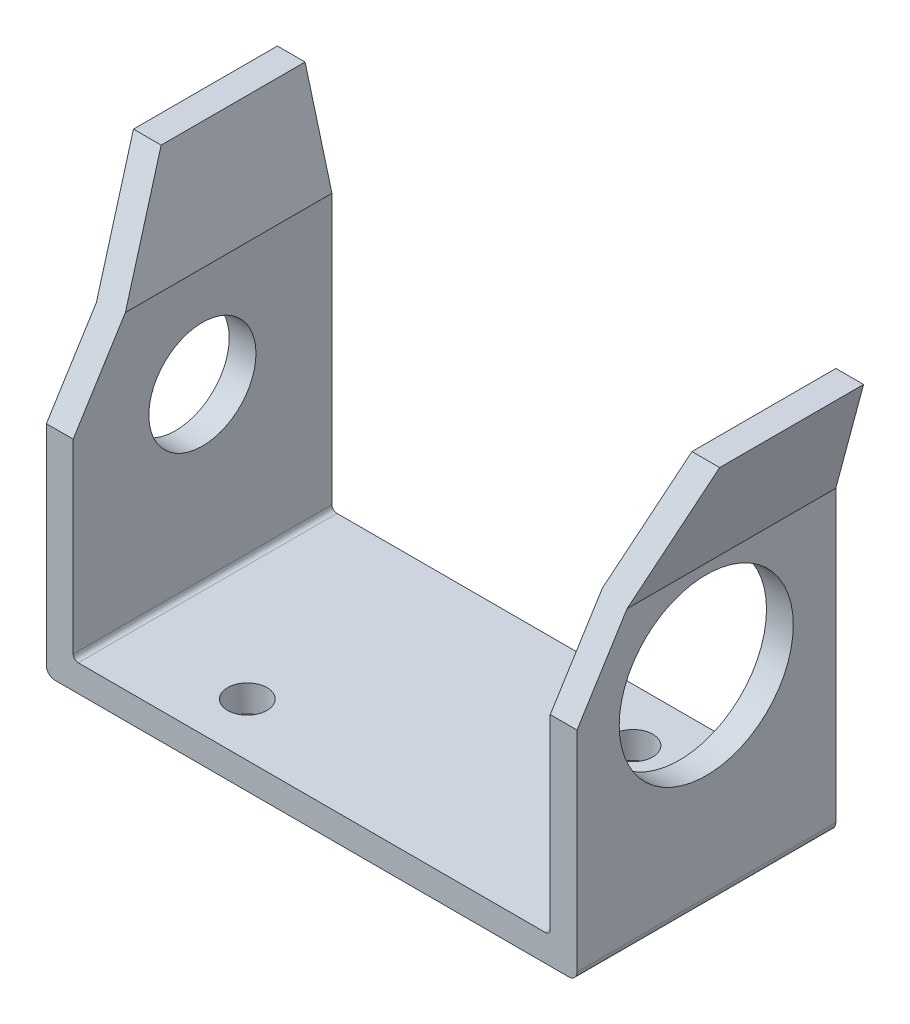
ISO-10303-21;
HEADER;
FILE_DESCRIPTION(('STEP AP214'),'2;1');
FILE_NAME('part.step','',(''),(''),'','','');
FILE_SCHEMA(('AUTOMOTIVE_DESIGN { 1 0 10303 214 1 1 1 1 }'));
ENDSEC;
DATA;
#1=APPLICATION_CONTEXT('core data for automotive mechanical design processes');
#2=APPLICATION_PROTOCOL_DEFINITION('international standard','automotive_design',2000,#1);
#3=PRODUCT_CONTEXT('',#1,'mechanical');
#4=PRODUCT('Part','Part','',(#3));
#5=PRODUCT_RELATED_PRODUCT_CATEGORY('part','',(#4));
#6=PRODUCT_DEFINITION_FORMATION('','',#4);
#7=PRODUCT_DEFINITION_CONTEXT('part definition',#1,'design');
#8=PRODUCT_DEFINITION('design','',#6,#7);
#9=PRODUCT_DEFINITION_SHAPE('','',#8);
#10=(LENGTH_UNIT() NAMED_UNIT(*) SI_UNIT(.MILLI.,.METRE.));
#11=(NAMED_UNIT(*) PLANE_ANGLE_UNIT() SI_UNIT($,.RADIAN.));
#12=(NAMED_UNIT(*) SI_UNIT($,.STERADIAN.) SOLID_ANGLE_UNIT());
#13=UNCERTAINTY_MEASURE_WITH_UNIT(LENGTH_MEASURE(1.E-05),#10,'distance_accuracy_value','');
#14=(GEOMETRIC_REPRESENTATION_CONTEXT(3) GLOBAL_UNCERTAINTY_ASSIGNED_CONTEXT((#13)) GLOBAL_UNIT_ASSIGNED_CONTEXT((#10,
#11,#12)) REPRESENTATION_CONTEXT('',''));
#15=CARTESIAN_POINT('',(0.,0.,0.));
#16=DIRECTION('',(0.,0.,1.));
#17=DIRECTION('',(1.,0.,0.));
#18=AXIS2_PLACEMENT_3D('',#15,#16,#17);
#19=CARTESIAN_POINT('',(6.975,-3.5,7.73));
#20=DIRECTION('',(0.,0.,-1.));
#21=DIRECTION('',(-1.,0.,0.));
#22=AXIS2_PLACEMENT_3D('',#19,#20,#21);
#23=CYLINDRICAL_SURFACE('',#22,0.15);
#24=DIRECTION('',(0.,0.,1.));
#25=VECTOR('',#24,1.);
#26=CARTESIAN_POINT('',(6.975,-3.65,7.73));
#27=LINE('',#26,#25);
#28=CARTESIAN_POINT('',(6.975,-3.65,0.));
#29=VERTEX_POINT('',#28);
#30=CARTESIAN_POINT('',(6.975,-3.65,7.73));
#31=VERTEX_POINT('',#30);
#32=EDGE_CURVE('E112',#29,#31,#27,.T.);
#33=ORIENTED_EDGE('',*,*,#32,.T.);
#34=CARTESIAN_POINT('',(6.975,-3.5,7.73));
#35=DIRECTION('',(0.,0.,-1.));
#36=DIRECTION('',(-1.,0.,0.));
#37=AXIS2_PLACEMENT_3D('',#34,#35,#36);
#38=CIRCLE('',#37,0.15);
#39=CARTESIAN_POINT('',(7.125,-3.5,7.73));
#40=VERTEX_POINT('',#39);
#41=EDGE_CURVE('E37',#40,#31,#38,.T.);
#42=ORIENTED_EDGE('',*,*,#41,.F.);
#43=DIRECTION('',(0.,0.,1.));
#44=VECTOR('',#43,1.);
#45=CARTESIAN_POINT('',(7.125,-3.5,7.73));
#46=LINE('',#45,#44);
#47=CARTESIAN_POINT('',(7.125,-3.5,0.));
#48=VERTEX_POINT('',#47);
#49=EDGE_CURVE('E200',#40,#48,#46,.F.);
#50=ORIENTED_EDGE('',*,*,#49,.T.);
#51=CARTESIAN_POINT('',(6.975,-3.5,0.));
#52=DIRECTION('',(0.,0.,-1.));
#53=DIRECTION('',(-1.,0.,0.));
#54=AXIS2_PLACEMENT_3D('',#51,#52,#53);
#55=CIRCLE('',#54,0.15);
#56=EDGE_CURVE('E109',#29,#48,#55,.F.);
#57=ORIENTED_EDGE('',*,*,#56,.F.);
#58=EDGE_LOOP('',(#33,#42,#50,#57));
#59=FACE_BOUND('',#58,.T.);
#60=ADVANCED_FACE('F34',(#59),#23,.F.);
#61=CARTESIAN_POINT('',(0.,7.55,7.73));
#62=DIRECTION('',(0.,-1.,0.));
#63=DIRECTION('',(0.,0.,-1.));
#64=AXIS2_PLACEMENT_3D('',#61,#62,#63);
#65=PLANE('',#64);
#66=DIRECTION('',(1.,0.,0.));
#67=VECTOR('',#66,1.);
#68=CARTESIAN_POINT('',(-8.75564249653648,7.55,4.29946725801778));
#69=LINE('',#68,#67);
#70=CARTESIAN_POINT('',(7.92742155220842,7.55,4.29946725801778));
#71=VERTEX_POINT('',#70);
#72=CARTESIAN_POINT('',(8.75564249653648,7.55,4.29946725801778));
#73=VERTEX_POINT('',#72);
#74=EDGE_CURVE('E269',#71,#73,#69,.T.);
#75=ORIENTED_EDGE('',*,*,#74,.T.);
#76=DIRECTION('',(0.,0.,1.));
#77=VECTOR('',#76,1.);
#78=CARTESIAN_POINT('',(8.75564249653648,7.55,7.73));
#79=LINE('',#78,#77);
#80=CARTESIAN_POINT('',(8.75564249653648,7.55,0.));
#81=VERTEX_POINT('',#80);
#82=EDGE_CURVE('E193',#81,#73,#79,.T.);
#83=ORIENTED_EDGE('',*,*,#82,.F.);
#84=DIRECTION('',(1.,0.,0.));
#85=VECTOR('',#84,1.);
#86=CARTESIAN_POINT('',(0.,7.55,0.));
#87=LINE('',#86,#85);
#88=CARTESIAN_POINT('',(7.92742155220842,7.55,0.));
#89=VERTEX_POINT('',#88);
#90=EDGE_CURVE('E272',#89,#81,#87,.T.);
#91=ORIENTED_EDGE('',*,*,#90,.F.);
#92=DIRECTION('',(0.,0.,1.));
#93=VECTOR('',#92,1.);
#94=CARTESIAN_POINT('',(7.92742155220842,7.55,7.73));
#95=LINE('',#94,#93);
#96=EDGE_CURVE('E222',#89,#71,#95,.T.);
#97=ORIENTED_EDGE('',*,*,#96,.T.);
#98=EDGE_LOOP('',(#75,#83,#91,#97));
#99=FACE_BOUND('',#98,.T.);
#100=ADVANCED_FACE('F404',(#99),#65,.F.);
#101=CARTESIAN_POINT('',(7.125,1.55,3.87));
#102=DIRECTION('',(1.,0.,0.));
#103=DIRECTION('',(0.,0.,-1.));
#104=AXIS2_PLACEMENT_3D('',#101,#102,#103);
#105=CYLINDRICAL_SURFACE('',#104,2.6);
#106=CARTESIAN_POINT('',(7.125,1.55,3.87));
#107=DIRECTION('',(1.,0.,0.));
#108=DIRECTION('',(0.,0.,-1.));
#109=AXIS2_PLACEMENT_3D('',#106,#107,#108);
#110=CIRCLE('',#109,2.6);
#111=CARTESIAN_POINT('',(7.125,1.55,1.27));
#112=VERTEX_POINT('',#111);
#113=EDGE_CURVE('E203',#112,#112,#110,.F.);
#114=ORIENTED_EDGE('',*,*,#113,.T.);
#115=EDGE_LOOP('',(#114));
#116=FACE_BOUND('',#115,.T.);
#117=CARTESIAN_POINT('',(7.925,1.55,3.87));
#118=DIRECTION('',(1.,0.,0.));
#119=DIRECTION('',(0.,0.,-1.));
#120=AXIS2_PLACEMENT_3D('',#117,#118,#119);
#121=CIRCLE('',#120,2.6);
#122=CARTESIAN_POINT('',(7.925,1.55,1.27));
#123=VERTEX_POINT('',#122);
#124=EDGE_CURVE('E196',#123,#123,#121,.T.);
#125=ORIENTED_EDGE('',*,*,#124,.T.);
#126=EDGE_LOOP('',(#125));
#127=FACE_BOUND('',#126,.T.);
#128=ADVANCED_FACE('F468',(#116,#127),#105,.F.);
#129=CARTESIAN_POINT('',(-8.75564249653648,2.06,7.73));
#130=DIRECTION('',(0.,-0.529919264233206,-0.848048096156425));
#131=DIRECTION('',(0.,0.848048096156425,-0.529919264233206));
#132=AXIS2_PLACEMENT_3D('',#129,#130,#131);
#133=PLANE('',#132);
#134=DIRECTION('',(0.,0.848048096156425,-0.529919264233207));
#135=VECTOR('',#134,1.);
#136=CARTESIAN_POINT('',(7.925,2.06,7.73));
#137=LINE('',#136,#135);
#138=CARTESIAN_POINT('',(7.925,2.06,7.73));
#139=VERTEX_POINT('',#138);
#140=CARTESIAN_POINT('',(7.925,4.45,6.2365622489367));
#141=VERTEX_POINT('',#140);
#142=EDGE_CURVE('E183',#139,#141,#137,.T.);
#143=ORIENTED_EDGE('',*,*,#142,.T.);
#144=DIRECTION('',(-0.221585010600198,-0.826966517755628,0.516746032000673));
#145=VECTOR('',#144,1.);
#146=CARTESIAN_POINT('',(8.75564249653648,7.55,4.29946725801778));
#147=LINE('',#146,#145);
#148=EDGE_CURVE('E197',#73,#141,#147,.T.);
#149=ORIENTED_EDGE('',*,*,#148,.F.);
#150=ORIENTED_EDGE('',*,*,#74,.F.);
#151=DIRECTION('',(-0.221585010600199,-0.826966517755627,0.516746032000674));
#152=VECTOR('',#151,1.);
#153=CARTESIAN_POINT('',(7.92742155220842,7.55,4.29946725801778));
#154=LINE('',#153,#152);
#155=CARTESIAN_POINT('',(7.125,4.55532199806992,6.17074976026096));
#156=VERTEX_POINT('',#155);
#157=EDGE_CURVE('E207',#71,#156,#154,.T.);
#158=ORIENTED_EDGE('',*,*,#157,.T.);
#159=DIRECTION('',(0.,-0.848048096156425,0.529919264233207));
#160=VECTOR('',#159,1.);
#161=CARTESIAN_POINT('',(7.125,4.55532199806992,6.17074976026096));
#162=LINE('',#161,#160);
#163=CARTESIAN_POINT('',(7.125,2.06,7.73));
#164=VERTEX_POINT('',#163);
#165=EDGE_CURVE('E202',#156,#164,#162,.T.);
#166=ORIENTED_EDGE('',*,*,#165,.T.);
#167=DIRECTION('',(1.,0.,0.));
#168=VECTOR('',#167,1.);
#169=CARTESIAN_POINT('',(-8.75564249653648,2.06,7.73));
#170=LINE('',#169,#168);
#171=EDGE_CURVE('E248',#139,#164,#170,.F.);
#172=ORIENTED_EDGE('',*,*,#171,.F.);
#173=EDGE_LOOP('',(#143,#149,#150,#158,#166,#172));
#174=FACE_BOUND('',#173,.T.);
#175=ADVANCED_FACE('F397',(#174),#133,.F.);
#176=CARTESIAN_POINT('',(0.,7.55,7.73));
#177=DIRECTION('',(0.,1.,0.));
#178=DIRECTION('',(0.,0.,1.));
#179=AXIS2_PLACEMENT_3D('',#176,#177,#178);
#180=PLANE('',#179);
#181=DIRECTION('',(1.,0.,0.));
#182=VECTOR('',#181,1.);
#183=CARTESIAN_POINT('',(0.,7.55,0.));
#184=LINE('',#183,#182);
#185=CARTESIAN_POINT('',(-7.92742155220842,7.55,0.));
#186=VERTEX_POINT('',#185);
#187=CARTESIAN_POINT('',(-8.75564249653648,7.55,0.));
#188=VERTEX_POINT('',#187);
#189=EDGE_CURVE('E244',#186,#188,#184,.F.);
#190=ORIENTED_EDGE('',*,*,#189,.T.);
#191=DIRECTION('',(0.,0.,1.));
#192=VECTOR('',#191,1.);
#193=CARTESIAN_POINT('',(-8.75564249653648,7.55,7.73));
#194=LINE('',#193,#192);
#195=CARTESIAN_POINT('',(-8.75564249653648,7.55,4.29946725801778));
#196=VERTEX_POINT('',#195);
#197=EDGE_CURVE('E232',#188,#196,#194,.T.);
#198=ORIENTED_EDGE('',*,*,#197,.T.);
#199=DIRECTION('',(1.,0.,0.));
#200=VECTOR('',#199,1.);
#201=CARTESIAN_POINT('',(-8.75564249653648,7.55,4.29946725801778));
#202=LINE('',#201,#200);
#203=CARTESIAN_POINT('',(-7.92742155220842,7.55,4.29946725801778));
#204=VERTEX_POINT('',#203);
#205=EDGE_CURVE('E241',#196,#204,#202,.T.);
#206=ORIENTED_EDGE('',*,*,#205,.T.);
#207=DIRECTION('',(0.,0.,1.));
#208=VECTOR('',#207,1.);
#209=CARTESIAN_POINT('',(-7.92742155220842,7.55,7.73));
#210=LINE('',#209,#208);
#211=EDGE_CURVE('E157',#186,#204,#210,.T.);
#212=ORIENTED_EDGE('',*,*,#211,.F.);
#213=EDGE_LOOP('',(#190,#198,#206,#212));
#214=FACE_BOUND('',#213,.T.);
#215=ADVANCED_FACE('F461',(#214),#180,.T.);
#216=CARTESIAN_POINT('',(-8.75564249653648,1.55,3.87));
#217=DIRECTION('',(1.,0.,0.));
#218=DIRECTION('',(0.,0.,-1.));
#219=AXIS2_PLACEMENT_3D('',#216,#217,#218);
#220=CYLINDRICAL_SURFACE('',#219,1.59999218748093);
#221=CARTESIAN_POINT('',(-7.125,1.55,3.87));
#222=DIRECTION('',(1.,0.,0.));
#223=DIRECTION('',(0.,0.,-1.));
#224=AXIS2_PLACEMENT_3D('',#221,#222,#223);
#225=CIRCLE('',#224,1.59999218748093);
#226=CARTESIAN_POINT('',(-7.125,1.55,2.27000781251907));
#227=VERTEX_POINT('',#226);
#228=EDGE_CURVE('E143',#227,#227,#225,.T.);
#229=ORIENTED_EDGE('',*,*,#228,.T.);
#230=EDGE_LOOP('',(#229));
#231=FACE_BOUND('',#230,.T.);
#232=CARTESIAN_POINT('',(-7.925,1.55,3.87));
#233=DIRECTION('',(1.,0.,0.));
#234=DIRECTION('',(0.,0.,-1.));
#235=AXIS2_PLACEMENT_3D('',#232,#233,#234);
#236=CIRCLE('',#235,1.59999218748093);
#237=CARTESIAN_POINT('',(-7.925,1.55,2.27000781251907));
#238=VERTEX_POINT('',#237);
#239=EDGE_CURVE('E182',#238,#238,#236,.F.);
#240=ORIENTED_EDGE('',*,*,#239,.T.);
#241=EDGE_LOOP('',(#240));
#242=FACE_BOUND('',#241,.T.);
#243=ADVANCED_FACE('F457',(#231,#242),#220,.F.);
#244=CARTESIAN_POINT('',(-6.975,-3.5,7.73));
#245=DIRECTION('',(0.,0.,-1.));
#246=DIRECTION('',(-1.,0.,0.));
#247=AXIS2_PLACEMENT_3D('',#244,#245,#246);
#248=CYLINDRICAL_SURFACE('',#247,0.15);
#249=DIRECTION('',(0.,0.,1.));
#250=VECTOR('',#249,1.);
#251=CARTESIAN_POINT('',(-7.125,-3.5,7.73));
#252=LINE('',#251,#250);
#253=CARTESIAN_POINT('',(-7.125,-3.5,0.));
#254=VERTEX_POINT('',#253);
#255=CARTESIAN_POINT('',(-7.125,-3.5,7.73));
#256=VERTEX_POINT('',#255);
#257=EDGE_CURVE('E139',#254,#256,#252,.T.);
#258=ORIENTED_EDGE('',*,*,#257,.T.);
#259=CARTESIAN_POINT('',(-6.975,-3.5,7.73));
#260=DIRECTION('',(0.,0.,-1.));
#261=DIRECTION('',(-1.,0.,0.));
#262=AXIS2_PLACEMENT_3D('',#259,#260,#261);
#263=CIRCLE('',#262,0.15);
#264=CARTESIAN_POINT('',(-6.975,-3.65,7.73));
#265=VERTEX_POINT('',#264);
#266=EDGE_CURVE('E247',#265,#256,#263,.T.);
#267=ORIENTED_EDGE('',*,*,#266,.F.);
#268=DIRECTION('',(0.,0.,1.));
#269=VECTOR('',#268,1.);
#270=CARTESIAN_POINT('',(-6.975,-3.65,7.73));
#271=LINE('',#270,#269);
#272=CARTESIAN_POINT('',(-6.975,-3.65,0.));
#273=VERTEX_POINT('',#272);
#274=EDGE_CURVE('E116',#265,#273,#271,.F.);
#275=ORIENTED_EDGE('',*,*,#274,.T.);
#276=CARTESIAN_POINT('',(-6.975,-3.5,0.));
#277=DIRECTION('',(0.,0.,-1.));
#278=DIRECTION('',(-1.,0.,0.));
#279=AXIS2_PLACEMENT_3D('',#276,#277,#278);
#280=CIRCLE('',#279,0.15);
#281=EDGE_CURVE('E253',#254,#273,#280,.F.);
#282=ORIENTED_EDGE('',*,*,#281,.F.);
#283=EDGE_LOOP('',(#258,#267,#275,#282));
#284=FACE_BOUND('',#283,.T.);
#285=ADVANCED_FACE('F450',(#284),#248,.F.);
#286=CARTESIAN_POINT('',(-8.75564249653648,2.06,7.73));
#287=DIRECTION('',(0.,-0.529919264233206,-0.848048096156425));
#288=DIRECTION('',(0.,0.848048096156425,-0.529919264233206));
#289=AXIS2_PLACEMENT_3D('',#286,#287,#288);
#290=PLANE('',#289);
#291=DIRECTION('',(0.,0.848048096156425,-0.529919264233207));
#292=VECTOR('',#291,1.);
#293=CARTESIAN_POINT('',(-7.125,2.06,7.73));
#294=LINE('',#293,#292);
#295=CARTESIAN_POINT('',(-7.125,2.06,7.73));
#296=VERTEX_POINT('',#295);
#297=CARTESIAN_POINT('',(-7.125,4.55532199806992,6.17074976026095));
#298=VERTEX_POINT('',#297);
#299=EDGE_CURVE('E142',#296,#298,#294,.T.);
#300=ORIENTED_EDGE('',*,*,#299,.T.);
#301=DIRECTION('',(0.221585010600199,-0.826966517755628,0.516746032000674));
#302=VECTOR('',#301,1.);
#303=CARTESIAN_POINT('',(-7.92742155220842,7.55,4.29946725801778));
#304=LINE('',#303,#302);
#305=EDGE_CURVE('E160',#204,#298,#304,.T.);
#306=ORIENTED_EDGE('',*,*,#305,.F.);
#307=ORIENTED_EDGE('',*,*,#205,.F.);
#308=DIRECTION('',(0.221585010600198,-0.826966517755628,0.516746032000673));
#309=VECTOR('',#308,1.);
#310=CARTESIAN_POINT('',(-8.75564249653648,7.55,4.29946725801778));
#311=LINE('',#310,#309);
#312=CARTESIAN_POINT('',(-7.925,4.45,6.2365622489367));
#313=VERTEX_POINT('',#312);
#314=EDGE_CURVE('E166',#196,#313,#311,.T.);
#315=ORIENTED_EDGE('',*,*,#314,.T.);
#316=DIRECTION('',(0.,-0.848048096156425,0.529919264233206));
#317=VECTOR('',#316,1.);
#318=CARTESIAN_POINT('',(-7.925,4.45,6.2365622489367));
#319=LINE('',#318,#317);
#320=CARTESIAN_POINT('',(-7.925,2.06,7.73));
#321=VERTEX_POINT('',#320);
#322=EDGE_CURVE('E229',#313,#321,#319,.T.);
#323=ORIENTED_EDGE('',*,*,#322,.T.);
#324=DIRECTION('',(1.,0.,0.));
#325=VECTOR('',#324,1.);
#326=CARTESIAN_POINT('',(-8.75564249653648,2.06,7.73));
#327=LINE('',#326,#325);
#328=EDGE_CURVE('E117',#296,#321,#327,.F.);
#329=ORIENTED_EDGE('',*,*,#328,.F.);
#330=EDGE_LOOP('',(#300,#306,#307,#315,#323,#329));
#331=FACE_BOUND('',#330,.T.);
#332=ADVANCED_FACE('F442',(#331),#290,.F.);
#333=CARTESIAN_POINT('',(-6.975,-3.65,7.73));
#334=DIRECTION('',(0.,-1.,0.));
#335=DIRECTION('',(1.,0.,0.));
#336=AXIS2_PLACEMENT_3D('',#333,#334,#335);
#337=PLANE('',#336);
#338=CARTESIAN_POINT('',(-3.5125,-3.65,6.1425));
#339=DIRECTION('',(0.,-1.,0.));
#340=DIRECTION('',(1.,0.,0.));
#341=AXIS2_PLACEMENT_3D('',#338,#339,#340);
#342=CIRCLE('',#341,0.590549999999993);
#343=CARTESIAN_POINT('',(-2.92195000000001,-3.65,6.1425));
#344=VERTEX_POINT('',#343);
#345=EDGE_CURVE('E420',#344,#344,#342,.T.);
#346=ORIENTED_EDGE('',*,*,#345,.T.);
#347=EDGE_LOOP('',(#346));
#348=FACE_BOUND('',#347,.T.);
#349=CARTESIAN_POINT('',(3.4525,-3.65,1.5875));
#350=DIRECTION('',(0.,-1.,0.));
#351=DIRECTION('',(1.,0.,0.));
#352=AXIS2_PLACEMENT_3D('',#349,#350,#351);
#353=CIRCLE('',#352,0.590549999999993);
#354=CARTESIAN_POINT('',(4.04304999999999,-3.65,1.5875));
#355=VERTEX_POINT('',#354);
#356=EDGE_CURVE('E110',#355,#355,#353,.T.);
#357=ORIENTED_EDGE('',*,*,#356,.T.);
#358=EDGE_LOOP('',(#357));
#359=FACE_BOUND('',#358,.T.);
#360=ORIENTED_EDGE('',*,*,#274,.F.);
#361=DIRECTION('',(-1.,0.,0.));
#362=VECTOR('',#361,1.);
#363=CARTESIAN_POINT('',(-6.975,-3.65,7.73));
#364=LINE('',#363,#362);
#365=EDGE_CURVE('E106',#265,#31,#364,.F.);
#366=ORIENTED_EDGE('',*,*,#365,.T.);
#367=ORIENTED_EDGE('',*,*,#32,.F.);
#368=DIRECTION('',(-1.,0.,0.));
#369=VECTOR('',#368,1.);
#370=CARTESIAN_POINT('',(-6.975,-3.65,0.));
#371=LINE('',#370,#369);
#372=EDGE_CURVE('E294',#273,#29,#371,.F.);
#373=ORIENTED_EDGE('',*,*,#372,.F.);
#374=EDGE_LOOP('',(#360,#366,#367,#373));
#375=FACE_BOUND('',#374,.T.);
#376=ADVANCED_FACE('F120',(#348,#359,#375),#337,.F.);
#377=CARTESIAN_POINT('',(7.125,4.45,7.73));
#378=DIRECTION('',(1.,0.,0.));
#379=DIRECTION('',(0.,1.,0.));
#380=AXIS2_PLACEMENT_3D('',#377,#378,#379);
#381=PLANE('',#380);
#382=ORIENTED_EDGE('',*,*,#165,.F.);
#383=DIRECTION('',(0.,0.,1.));
#384=VECTOR('',#383,1.);
#385=CARTESIAN_POINT('',(7.125,4.55532199806992,7.73));
#386=LINE('',#385,#384);
#387=CARTESIAN_POINT('',(7.12500000000001,4.55532199806994,0.));
#388=VERTEX_POINT('',#387);
#389=EDGE_CURVE('E204',#156,#388,#386,.F.);
#390=ORIENTED_EDGE('',*,*,#389,.T.);
#391=DIRECTION('',(0.,1.,0.));
#392=VECTOR('',#391,1.);
#393=CARTESIAN_POINT('',(7.125,-3.5,0.));
#394=LINE('',#393,#392);
#395=EDGE_CURVE('E212',#48,#388,#394,.T.);
#396=ORIENTED_EDGE('',*,*,#395,.F.);
#397=ORIENTED_EDGE('',*,*,#49,.F.);
#398=DIRECTION('',(0.,1.,0.));
#399=VECTOR('',#398,1.);
#400=CARTESIAN_POINT('',(7.125,-3.5,7.73));
#401=LINE('',#400,#399);
#402=EDGE_CURVE('E108',#40,#164,#401,.T.);
#403=ORIENTED_EDGE('',*,*,#402,.T.);
#404=EDGE_LOOP('',(#382,#390,#396,#397,#403));
#405=FACE_BOUND('',#404,.T.);
#406=ORIENTED_EDGE('',*,*,#113,.F.);
#407=EDGE_LOOP('',(#406));
#408=FACE_BOUND('',#407,.T.);
#409=ADVANCED_FACE('F311',(#405,#408),#381,.F.);
#410=CARTESIAN_POINT('',(1.73307400330687,-15.5676197722403,7.73));
#411=DIRECTION('',(0.965925826289068,-0.258819045102521,0.));
#412=DIRECTION('',(0.258819045102521,0.965925826289068,0.));
#413=AXIS2_PLACEMENT_3D('',#410,#411,#412);
#414=PLANE('',#413);
#415=ORIENTED_EDGE('',*,*,#157,.F.);
#416=ORIENTED_EDGE('',*,*,#96,.F.);
#417=DIRECTION('',(0.258819045102521,0.965925826289068,0.));
#418=VECTOR('',#417,1.);
#419=CARTESIAN_POINT('',(7.125,4.55532199806992,0.));
#420=LINE('',#419,#418);
#421=EDGE_CURVE('E190',#388,#89,#420,.T.);
#422=ORIENTED_EDGE('',*,*,#421,.F.);
#423=ORIENTED_EDGE('',*,*,#389,.F.);
#424=EDGE_LOOP('',(#415,#416,#422,#423));
#425=FACE_BOUND('',#424,.T.);
#426=ADVANCED_FACE('F402',(#425),#414,.F.);
#427=CARTESIAN_POINT('',(2.50581466433813,-15.7746750083223,7.73));
#428=DIRECTION('',(0.965925826289068,-0.258819045102521,0.));
#429=DIRECTION('',(0.258819045102521,0.965925826289068,0.));
#430=AXIS2_PLACEMENT_3D('',#427,#428,#429);
#431=PLANE('',#430);
#432=DIRECTION('',(-0.258819045102521,-0.965925826289068,0.));
#433=VECTOR('',#432,1.);
#434=CARTESIAN_POINT('',(8.75564249653648,7.55,0.));
#435=LINE('',#434,#433);
#436=CARTESIAN_POINT('',(7.925,4.45000000000001,0.));
#437=VERTEX_POINT('',#436);
#438=EDGE_CURVE('E186',#81,#437,#435,.T.);
#439=ORIENTED_EDGE('',*,*,#438,.F.);
#440=ORIENTED_EDGE('',*,*,#82,.T.);
#441=ORIENTED_EDGE('',*,*,#148,.T.);
#442=DIRECTION('',(0.,0.,1.));
#443=VECTOR('',#442,1.);
#444=CARTESIAN_POINT('',(7.925,4.45,7.73));
#445=LINE('',#444,#443);
#446=EDGE_CURVE('E179',#141,#437,#445,.F.);
#447=ORIENTED_EDGE('',*,*,#446,.T.);
#448=EDGE_LOOP('',(#439,#440,#441,#447));
#449=FACE_BOUND('',#448,.T.);
#450=ADVANCED_FACE('F406',(#449),#431,.T.);
#451=CARTESIAN_POINT('',(7.925,4.45,7.73));
#452=DIRECTION('',(-1.,0.,0.));
#453=DIRECTION('',(0.,0.,1.));
#454=AXIS2_PLACEMENT_3D('',#451,#452,#453);
#455=PLANE('',#454);
#456=ORIENTED_EDGE('',*,*,#142,.F.);
#457=DIRECTION('',(0.,1.,0.));
#458=VECTOR('',#457,1.);
#459=CARTESIAN_POINT('',(7.925,-3.5,7.73));
#460=LINE('',#459,#458);
#461=CARTESIAN_POINT('',(7.925,-4.2,7.73));
#462=VERTEX_POINT('',#461);
#463=EDGE_CURVE('E124',#139,#462,#460,.F.);
#464=ORIENTED_EDGE('',*,*,#463,.T.);
#465=DIRECTION('',(0.,0.,-1.));
#466=VECTOR('',#465,1.);
#467=CARTESIAN_POINT('',(7.925,-4.2,7.73));
#468=LINE('',#467,#466);
#469=CARTESIAN_POINT('',(7.925,-4.2,0.));
#470=VERTEX_POINT('',#469);
#471=EDGE_CURVE('E176',#470,#462,#468,.F.);
#472=ORIENTED_EDGE('',*,*,#471,.F.);
#473=DIRECTION('',(0.,1.,0.));
#474=VECTOR('',#473,1.);
#475=CARTESIAN_POINT('',(7.925,-3.5,0.));
#476=LINE('',#475,#474);
#477=EDGE_CURVE('E189',#437,#470,#476,.F.);
#478=ORIENTED_EDGE('',*,*,#477,.F.);
#479=ORIENTED_EDGE('',*,*,#446,.F.);
#480=EDGE_LOOP('',(#456,#464,#472,#478,#479));
#481=FACE_BOUND('',#480,.T.);
#482=ORIENTED_EDGE('',*,*,#124,.F.);
#483=EDGE_LOOP('',(#482));
#484=FACE_BOUND('',#483,.T.);
#485=ADVANCED_FACE('F339',(#481,#484),#455,.F.);
#486=CARTESIAN_POINT('',(-7.925,4.45,7.73));
#487=DIRECTION('',(1.,0.,0.));
#488=DIRECTION('',(0.,0.,-1.));
#489=AXIS2_PLACEMENT_3D('',#486,#487,#488);
#490=PLANE('',#489);
#491=ORIENTED_EDGE('',*,*,#322,.F.);
#492=DIRECTION('',(0.,0.,1.));
#493=VECTOR('',#492,1.);
#494=CARTESIAN_POINT('',(-7.925,4.45,7.73));
#495=LINE('',#494,#493);
#496=CARTESIAN_POINT('',(-7.925,4.44999999999999,0.));
#497=VERTEX_POINT('',#496);
#498=EDGE_CURVE('E163',#313,#497,#495,.F.);
#499=ORIENTED_EDGE('',*,*,#498,.T.);
#500=DIRECTION('',(0.,1.,0.));
#501=VECTOR('',#500,1.);
#502=CARTESIAN_POINT('',(-7.925,-3.5,0.));
#503=LINE('',#502,#501);
#504=CARTESIAN_POINT('',(-7.925,-4.2,0.));
#505=VERTEX_POINT('',#504);
#506=EDGE_CURVE('E171',#505,#497,#503,.T.);
#507=ORIENTED_EDGE('',*,*,#506,.F.);
#508=DIRECTION('',(0.,0.,-1.));
#509=VECTOR('',#508,1.);
#510=CARTESIAN_POINT('',(-7.925,-4.2,7.73));
#511=LINE('',#510,#509);
#512=CARTESIAN_POINT('',(-7.925,-4.2,7.73));
#513=VERTEX_POINT('',#512);
#514=EDGE_CURVE('E147',#513,#505,#511,.T.);
#515=ORIENTED_EDGE('',*,*,#514,.F.);
#516=DIRECTION('',(0.,1.,0.));
#517=VECTOR('',#516,1.);
#518=CARTESIAN_POINT('',(-7.925,-3.5,7.73));
#519=LINE('',#518,#517);
#520=EDGE_CURVE('E127',#513,#321,#519,.T.);
#521=ORIENTED_EDGE('',*,*,#520,.T.);
#522=EDGE_LOOP('',(#491,#499,#507,#515,#521));
#523=FACE_BOUND('',#522,.T.);
#524=ORIENTED_EDGE('',*,*,#239,.F.);
#525=EDGE_LOOP('',(#524));
#526=FACE_BOUND('',#525,.T.);
#527=ADVANCED_FACE('F558',(#523,#526),#490,.F.);
#528=CARTESIAN_POINT('',(-2.50581466433813,-15.7746750083223,7.73));
#529=DIRECTION('',(0.965925826289068,0.258819045102521,0.));
#530=DIRECTION('',(-0.258819045102521,0.965925826289068,0.));
#531=AXIS2_PLACEMENT_3D('',#528,#529,#530);
#532=PLANE('',#531);
#533=ORIENTED_EDGE('',*,*,#314,.F.);
#534=ORIENTED_EDGE('',*,*,#197,.F.);
#535=DIRECTION('',(-0.258819045102521,0.965925826289068,0.));
#536=VECTOR('',#535,1.);
#537=CARTESIAN_POINT('',(-7.925,4.45,0.));
#538=LINE('',#537,#536);
#539=EDGE_CURVE('E154',#497,#188,#538,.T.);
#540=ORIENTED_EDGE('',*,*,#539,.F.);
#541=ORIENTED_EDGE('',*,*,#498,.F.);
#542=EDGE_LOOP('',(#533,#534,#540,#541));
#543=FACE_BOUND('',#542,.T.);
#544=ADVANCED_FACE('F550',(#543),#532,.F.);
#545=CARTESIAN_POINT('',(-1.73307400330687,-15.5676197722403,7.73));
#546=DIRECTION('',(0.965925826289068,0.258819045102521,0.));
#547=DIRECTION('',(-0.258819045102521,0.965925826289068,0.));
#548=AXIS2_PLACEMENT_3D('',#545,#546,#547);
#549=PLANE('',#548);
#550=DIRECTION('',(0.258819045102521,-0.965925826289068,0.));
#551=VECTOR('',#550,1.);
#552=CARTESIAN_POINT('',(-7.92742155220842,7.55,0.));
#553=LINE('',#552,#551);
#554=CARTESIAN_POINT('',(-7.125,4.55532199806992,0.));
#555=VERTEX_POINT('',#554);
#556=EDGE_CURVE('E150',#186,#555,#553,.T.);
#557=ORIENTED_EDGE('',*,*,#556,.F.);
#558=ORIENTED_EDGE('',*,*,#211,.T.);
#559=ORIENTED_EDGE('',*,*,#305,.T.);
#560=DIRECTION('',(0.,0.,1.));
#561=VECTOR('',#560,1.);
#562=CARTESIAN_POINT('',(-7.125,4.55532199806992,7.73));
#563=LINE('',#562,#561);
#564=EDGE_CURVE('E144',#298,#555,#563,.F.);
#565=ORIENTED_EDGE('',*,*,#564,.T.);
#566=EDGE_LOOP('',(#557,#558,#559,#565));
#567=FACE_BOUND('',#566,.T.);
#568=ADVANCED_FACE('F540',(#567),#549,.T.);
#569=CARTESIAN_POINT('',(-7.125,4.45,7.73));
#570=DIRECTION('',(-1.,0.,0.));
#571=DIRECTION('',(0.,0.,1.));
#572=AXIS2_PLACEMENT_3D('',#569,#570,#571);
#573=PLANE('',#572);
#574=ORIENTED_EDGE('',*,*,#299,.F.);
#575=DIRECTION('',(0.,1.,0.));
#576=VECTOR('',#575,1.);
#577=CARTESIAN_POINT('',(-7.125,-3.5,7.73));
#578=LINE('',#577,#576);
#579=EDGE_CURVE('E122',#296,#256,#578,.F.);
#580=ORIENTED_EDGE('',*,*,#579,.T.);
#581=ORIENTED_EDGE('',*,*,#257,.F.);
#582=DIRECTION('',(0.,1.,0.));
#583=VECTOR('',#582,1.);
#584=CARTESIAN_POINT('',(-7.125,-3.5,0.));
#585=LINE('',#584,#583);
#586=EDGE_CURVE('E153',#555,#254,#585,.F.);
#587=ORIENTED_EDGE('',*,*,#586,.F.);
#588=ORIENTED_EDGE('',*,*,#564,.F.);
#589=EDGE_LOOP('',(#574,#580,#581,#587,#588));
#590=FACE_BOUND('',#589,.T.);
#591=ORIENTED_EDGE('',*,*,#228,.F.);
#592=EDGE_LOOP('',(#591));
#593=FACE_BOUND('',#592,.T.);
#594=ADVANCED_FACE('F531',(#590,#593),#573,.F.);
#595=CARTESIAN_POINT('',(-7.675,-4.2,7.73));
#596=DIRECTION('',(0.,0.,-1.));
#597=DIRECTION('',(-1.,0.,0.));
#598=AXIS2_PLACEMENT_3D('',#595,#596,#597);
#599=CYLINDRICAL_SURFACE('',#598,0.25);
#600=CARTESIAN_POINT('',(-7.675,-4.2,7.73));
#601=DIRECTION('',(0.,0.,-1.));
#602=DIRECTION('',(-1.,0.,0.));
#603=AXIS2_PLACEMENT_3D('',#600,#601,#602);
#604=CIRCLE('',#603,0.25);
#605=CARTESIAN_POINT('',(-7.675,-4.45,7.73));
#606=VERTEX_POINT('',#605);
#607=EDGE_CURVE('E136',#606,#513,#604,.T.);
#608=ORIENTED_EDGE('',*,*,#607,.T.);
#609=ORIENTED_EDGE('',*,*,#514,.T.);
#610=CARTESIAN_POINT('',(-7.675,-4.2,0.));
#611=DIRECTION('',(0.,0.,-1.));
#612=DIRECTION('',(-1.,0.,0.));
#613=AXIS2_PLACEMENT_3D('',#610,#611,#612);
#614=CIRCLE('',#613,0.25);
#615=CARTESIAN_POINT('',(-7.675,-4.45,0.));
#616=VERTEX_POINT('',#615);
#617=EDGE_CURVE('E289',#616,#505,#614,.T.);
#618=ORIENTED_EDGE('',*,*,#617,.F.);
#619=DIRECTION('',(0.,0.,1.));
#620=VECTOR('',#619,1.);
#621=CARTESIAN_POINT('',(-7.675,-4.45,7.73));
#622=LINE('',#621,#620);
#623=EDGE_CURVE('E326',#616,#606,#622,.T.);
#624=ORIENTED_EDGE('',*,*,#623,.T.);
#625=EDGE_LOOP('',(#608,#609,#618,#624));
#626=FACE_BOUND('',#625,.T.);
#627=ADVANCED_FACE('F523',(#626),#599,.T.);
#628=CARTESIAN_POINT('',(-6.975,-3.5,7.73));
#629=DIRECTION('',(0.,0.,-1.));
#630=DIRECTION('',(-1.,0.,0.));
#631=AXIS2_PLACEMENT_3D('',#628,#629,#630);
#632=PLANE('',#631);
#633=ORIENTED_EDGE('',*,*,#171,.T.);
#634=ORIENTED_EDGE('',*,*,#402,.F.);
#635=ORIENTED_EDGE('',*,*,#41,.T.);
#636=ORIENTED_EDGE('',*,*,#365,.F.);
#637=ORIENTED_EDGE('',*,*,#266,.T.);
#638=ORIENTED_EDGE('',*,*,#579,.F.);
#639=ORIENTED_EDGE('',*,*,#328,.T.);
#640=ORIENTED_EDGE('',*,*,#520,.F.);
#641=ORIENTED_EDGE('',*,*,#607,.F.);
#642=DIRECTION('',(1.,0.,0.));
#643=VECTOR('',#642,1.);
#644=CARTESIAN_POINT('',(-7.675,-4.45,7.73));
#645=LINE('',#644,#643);
#646=CARTESIAN_POINT('',(7.675,-4.45,7.73));
#647=VERTEX_POINT('',#646);
#648=EDGE_CURVE('E324',#606,#647,#645,.T.);
#649=ORIENTED_EDGE('',*,*,#648,.T.);
#650=CARTESIAN_POINT('',(7.675,-4.2,7.73));
#651=DIRECTION('',(0.,0.,-1.));
#652=DIRECTION('',(-1.,0.,0.));
#653=AXIS2_PLACEMENT_3D('',#650,#651,#652);
#654=CIRCLE('',#653,0.25);
#655=EDGE_CURVE('E178',#462,#647,#654,.T.);
#656=ORIENTED_EDGE('',*,*,#655,.F.);
#657=ORIENTED_EDGE('',*,*,#463,.F.);
#658=EDGE_LOOP('',(#633,#634,#635,#636,#637,#638,#639,#640,#641,#649,#656,#657));
#659=FACE_BOUND('',#658,.T.);
#660=ADVANCED_FACE('F104',(#659),#632,.F.);
#661=CARTESIAN_POINT('',(7.675,-4.2,7.73));
#662=DIRECTION('',(0.,0.,-1.));
#663=DIRECTION('',(-1.,0.,0.));
#664=AXIS2_PLACEMENT_3D('',#661,#662,#663);
#665=CYLINDRICAL_SURFACE('',#664,0.25);
#666=ORIENTED_EDGE('',*,*,#655,.T.);
#667=DIRECTION('',(0.,0.,1.));
#668=VECTOR('',#667,1.);
#669=CARTESIAN_POINT('',(7.675,-4.45,7.73));
#670=LINE('',#669,#668);
#671=CARTESIAN_POINT('',(7.675,-4.45,0.));
#672=VERTEX_POINT('',#671);
#673=EDGE_CURVE('E43',#647,#672,#670,.F.);
#674=ORIENTED_EDGE('',*,*,#673,.T.);
#675=CARTESIAN_POINT('',(7.675,-4.2,0.));
#676=DIRECTION('',(0.,0.,-1.));
#677=DIRECTION('',(-1.,0.,0.));
#678=AXIS2_PLACEMENT_3D('',#675,#676,#677);
#679=CIRCLE('',#678,0.25);
#680=EDGE_CURVE('E51',#470,#672,#679,.T.);
#681=ORIENTED_EDGE('',*,*,#680,.F.);
#682=ORIENTED_EDGE('',*,*,#471,.T.);
#683=EDGE_LOOP('',(#666,#674,#681,#682));
#684=FACE_BOUND('',#683,.T.);
#685=ADVANCED_FACE('F346',(#684),#665,.T.);
#686=CARTESIAN_POINT('',(-6.975,-3.5,0.));
#687=DIRECTION('',(0.,0.,-1.));
#688=DIRECTION('',(-1.,0.,0.));
#689=AXIS2_PLACEMENT_3D('',#686,#687,#688);
#690=PLANE('',#689);
#691=ORIENTED_EDGE('',*,*,#556,.T.);
#692=ORIENTED_EDGE('',*,*,#586,.T.);
#693=ORIENTED_EDGE('',*,*,#281,.T.);
#694=ORIENTED_EDGE('',*,*,#372,.T.);
#695=ORIENTED_EDGE('',*,*,#56,.T.);
#696=ORIENTED_EDGE('',*,*,#395,.T.);
#697=ORIENTED_EDGE('',*,*,#421,.T.);
#698=ORIENTED_EDGE('',*,*,#90,.T.);
#699=ORIENTED_EDGE('',*,*,#438,.T.);
#700=ORIENTED_EDGE('',*,*,#477,.T.);
#701=ORIENTED_EDGE('',*,*,#680,.T.);
#702=DIRECTION('',(1.,0.,0.));
#703=VECTOR('',#702,1.);
#704=CARTESIAN_POINT('',(-7.675,-4.45,0.));
#705=LINE('',#704,#703);
#706=EDGE_CURVE('E11',#672,#616,#705,.F.);
#707=ORIENTED_EDGE('',*,*,#706,.T.);
#708=ORIENTED_EDGE('',*,*,#617,.T.);
#709=ORIENTED_EDGE('',*,*,#506,.T.);
#710=ORIENTED_EDGE('',*,*,#539,.T.);
#711=ORIENTED_EDGE('',*,*,#189,.F.);
#712=EDGE_LOOP('',(#691,#692,#693,#694,#695,#696,#697,#698,#699,#700,#701,#707,#708,#709,#710,#711));
#713=FACE_BOUND('',#712,.T.);
#714=ADVANCED_FACE('F307',(#713),#690,.T.);
#715=CARTESIAN_POINT('',(-7.675,-4.45,7.73));
#716=DIRECTION('',(0.,1.,0.));
#717=DIRECTION('',(0.,0.,1.));
#718=AXIS2_PLACEMENT_3D('',#715,#716,#717);
#719=PLANE('',#718);
#720=CARTESIAN_POINT('',(-3.5125,-4.45,6.1425));
#721=DIRECTION('',(0.,-1.,0.));
#722=DIRECTION('',(0.,0.,-1.));
#723=AXIS2_PLACEMENT_3D('',#720,#721,#722);
#724=CIRCLE('',#723,0.590549999999988);
#725=CARTESIAN_POINT('',(-3.5125,-4.45,5.55195000000001));
#726=VERTEX_POINT('',#725);
#727=EDGE_CURVE('E423',#726,#726,#724,.T.);
#728=ORIENTED_EDGE('',*,*,#727,.F.);
#729=EDGE_LOOP('',(#728));
#730=FACE_BOUND('',#729,.T.);
#731=CARTESIAN_POINT('',(3.4525,-4.45,1.5875));
#732=DIRECTION('',(0.,-1.,0.));
#733=DIRECTION('',(0.,0.,-1.));
#734=AXIS2_PLACEMENT_3D('',#731,#732,#733);
#735=CIRCLE('',#734,0.590549999999988);
#736=CARTESIAN_POINT('',(3.4525,-4.45,0.996950000000012));
#737=VERTEX_POINT('',#736);
#738=EDGE_CURVE('E417',#737,#737,#735,.T.);
#739=ORIENTED_EDGE('',*,*,#738,.F.);
#740=EDGE_LOOP('',(#739));
#741=FACE_BOUND('',#740,.T.);
#742=ORIENTED_EDGE('',*,*,#673,.F.);
#743=ORIENTED_EDGE('',*,*,#648,.F.);
#744=ORIENTED_EDGE('',*,*,#623,.F.);
#745=ORIENTED_EDGE('',*,*,#706,.F.);
#746=EDGE_LOOP('',(#742,#743,#744,#745));
#747=FACE_BOUND('',#746,.T.);
#748=ADVANCED_FACE('F348',(#730,#741,#747),#719,.F.);
#749=CARTESIAN_POINT('',(3.4525,-4.45,1.5875));
#750=DIRECTION('',(0.,-1.,0.));
#751=DIRECTION('',(0.,0.,-1.));
#752=AXIS2_PLACEMENT_3D('',#749,#750,#751);
#753=CYLINDRICAL_SURFACE('',#752,0.590549999999993);
#754=ORIENTED_EDGE('',*,*,#738,.T.);
#755=EDGE_LOOP('',(#754));
#756=FACE_BOUND('',#755,.T.);
#757=ORIENTED_EDGE('',*,*,#356,.F.);
#758=EDGE_LOOP('',(#757));
#759=FACE_BOUND('',#758,.T.);
#760=ADVANCED_FACE('F432',(#756,#759),#753,.F.);
#761=CARTESIAN_POINT('',(-3.5125,-4.45,6.1425));
#762=DIRECTION('',(0.,-1.,0.));
#763=DIRECTION('',(0.,0.,-1.));
#764=AXIS2_PLACEMENT_3D('',#761,#762,#763);
#765=CYLINDRICAL_SURFACE('',#764,0.590549999999993);
#766=ORIENTED_EDGE('',*,*,#727,.T.);
#767=EDGE_LOOP('',(#766));
#768=FACE_BOUND('',#767,.T.);
#769=ORIENTED_EDGE('',*,*,#345,.F.);
#770=EDGE_LOOP('',(#769));
#771=FACE_BOUND('',#770,.T.);
#772=ADVANCED_FACE('F427',(#768,#771),#765,.F.);
#773=CLOSED_SHELL('',(#60,#100,#128,#175,#215,#243,#285,#332,#376,#409,#426,#450,#485,#527,#544,
#568,#594,#627,#660,#685,#714,#748,#760,#772));
#774=MANIFOLD_SOLID_BREP('B2',#773);
#775=ADVANCED_BREP_SHAPE_REPRESENTATION('',(#18,#774),#14);
#776=SHAPE_DEFINITION_REPRESENTATION(#9,#775);
ENDSEC;
END-ISO-10303-21;
